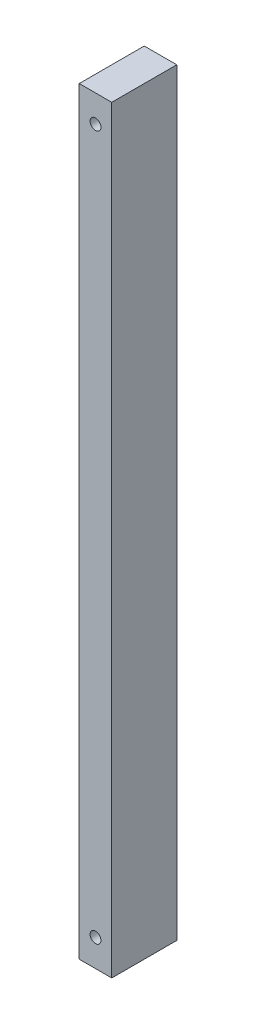
ISO-10303-21;
HEADER;
FILE_DESCRIPTION(('STEP AP214'),'2;1');
FILE_NAME('part.step','',(''),(''),'','','');
FILE_SCHEMA(('AUTOMOTIVE_DESIGN { 1 0 10303 214 1 1 1 1 }'));
ENDSEC;
DATA;
#1=APPLICATION_CONTEXT('core data for automotive mechanical design processes');
#2=APPLICATION_PROTOCOL_DEFINITION('international standard','automotive_design',2000,#1);
#3=PRODUCT_CONTEXT('',#1,'mechanical');
#4=PRODUCT('Part','Part','',(#3));
#5=PRODUCT_RELATED_PRODUCT_CATEGORY('part','',(#4));
#6=PRODUCT_DEFINITION_FORMATION('','',#4);
#7=PRODUCT_DEFINITION_CONTEXT('part definition',#1,'design');
#8=PRODUCT_DEFINITION('design','',#6,#7);
#9=PRODUCT_DEFINITION_SHAPE('','',#8);
#10=(LENGTH_UNIT() NAMED_UNIT(*) SI_UNIT(.MILLI.,.METRE.));
#11=(NAMED_UNIT(*) PLANE_ANGLE_UNIT() SI_UNIT($,.RADIAN.));
#12=(NAMED_UNIT(*) SI_UNIT($,.STERADIAN.) SOLID_ANGLE_UNIT());
#13=UNCERTAINTY_MEASURE_WITH_UNIT(LENGTH_MEASURE(1.E-05),#10,'distance_accuracy_value','');
#14=(GEOMETRIC_REPRESENTATION_CONTEXT(3) GLOBAL_UNCERTAINTY_ASSIGNED_CONTEXT((#13)) GLOBAL_UNIT_ASSIGNED_CONTEXT((#10,
#11,#12)) REPRESENTATION_CONTEXT('',''));
#15=CARTESIAN_POINT('',(0.,0.,0.));
#16=DIRECTION('',(0.,0.,1.));
#17=DIRECTION('',(1.,0.,0.));
#18=AXIS2_PLACEMENT_3D('',#15,#16,#17);
#19=CARTESIAN_POINT('',(19.05,0.,0.));
#20=DIRECTION('',(0.,0.,-1.));
#21=DIRECTION('',(-1.,0.,0.));
#22=AXIS2_PLACEMENT_3D('',#19,#20,#21);
#23=PLANE('',#22);
#24=CARTESIAN_POINT('',(9.525,428.625,0.));
#25=DIRECTION('',(0.,0.,1.));
#26=DIRECTION('',(1.,0.,0.));
#27=AXIS2_PLACEMENT_3D('',#24,#25,#26);
#28=CIRCLE('',#27,3.175);
#29=CARTESIAN_POINT('',(12.7,428.625,0.));
#30=VERTEX_POINT('',#29);
#31=EDGE_CURVE('E117',#30,#30,#28,.T.);
#32=ORIENTED_EDGE('',*,*,#31,.F.);
#33=EDGE_LOOP('',(#32));
#34=FACE_BOUND('',#33,.T.);
#35=CARTESIAN_POINT('',(9.52500000000005,15.875,0.));
#36=DIRECTION('',(0.,0.,1.));
#37=DIRECTION('',(1.,0.,0.));
#38=AXIS2_PLACEMENT_3D('',#35,#36,#37);
#39=CIRCLE('',#38,3.175);
#40=CARTESIAN_POINT('',(12.7000000000001,15.875,0.));
#41=VERTEX_POINT('',#40);
#42=EDGE_CURVE('E111',#41,#41,#39,.T.);
#43=ORIENTED_EDGE('',*,*,#42,.F.);
#44=EDGE_LOOP('',(#43));
#45=FACE_BOUND('',#44,.T.);
#46=DIRECTION('',(0.,-1.,0.));
#47=VECTOR('',#46,1.);
#48=CARTESIAN_POINT('',(0.,0.,0.));
#49=LINE('',#48,#47);
#50=CARTESIAN_POINT('',(0.,444.5,0.));
#51=VERTEX_POINT('',#50);
#52=CARTESIAN_POINT('',(0.,0.,0.));
#53=VERTEX_POINT('',#52);
#54=EDGE_CURVE('E97',#51,#53,#49,.T.);
#55=ORIENTED_EDGE('',*,*,#54,.T.);
#56=DIRECTION('',(-1.,0.,0.));
#57=VECTOR('',#56,1.);
#58=CARTESIAN_POINT('',(19.05,0.,0.));
#59=LINE('',#58,#57);
#60=CARTESIAN_POINT('',(19.05,0.,0.));
#61=VERTEX_POINT('',#60);
#62=EDGE_CURVE('E11',#61,#53,#59,.T.);
#63=ORIENTED_EDGE('',*,*,#62,.F.);
#64=DIRECTION('',(0.,-1.,0.));
#65=VECTOR('',#64,1.);
#66=CARTESIAN_POINT('',(19.05,0.,0.));
#67=LINE('',#66,#65);
#68=CARTESIAN_POINT('',(19.05,444.5,0.));
#69=VERTEX_POINT('',#68);
#70=EDGE_CURVE('E85',#69,#61,#67,.T.);
#71=ORIENTED_EDGE('',*,*,#70,.F.);
#72=DIRECTION('',(-1.,0.,0.));
#73=VECTOR('',#72,1.);
#74=CARTESIAN_POINT('',(19.05,444.5,0.));
#75=LINE('',#74,#73);
#76=EDGE_CURVE('E93',#69,#51,#75,.T.);
#77=ORIENTED_EDGE('',*,*,#76,.T.);
#78=EDGE_LOOP('',(#55,#63,#71,#77));
#79=FACE_BOUND('',#78,.T.);
#80=ADVANCED_FACE('F34',(#34,#45,#79),#23,.F.);
#81=CARTESIAN_POINT('',(19.05,0.,0.));
#82=DIRECTION('',(0.,1.,0.));
#83=DIRECTION('',(0.,0.,1.));
#84=AXIS2_PLACEMENT_3D('',#81,#82,#83);
#85=PLANE('',#84);
#86=DIRECTION('',(0.,0.,-1.));
#87=VECTOR('',#86,1.);
#88=CARTESIAN_POINT('',(0.,0.,0.));
#89=LINE('',#88,#87);
#90=CARTESIAN_POINT('',(0.,0.,-38.1));
#91=VERTEX_POINT('',#90);
#92=EDGE_CURVE('E89',#53,#91,#89,.T.);
#93=ORIENTED_EDGE('',*,*,#92,.T.);
#94=DIRECTION('',(-1.,0.,0.));
#95=VECTOR('',#94,1.);
#96=CARTESIAN_POINT('',(19.05,0.,-38.1));
#97=LINE('',#96,#95);
#98=CARTESIAN_POINT('',(19.05,0.,-38.1));
#99=VERTEX_POINT('',#98);
#100=EDGE_CURVE('E42',#99,#91,#97,.T.);
#101=ORIENTED_EDGE('',*,*,#100,.F.);
#102=DIRECTION('',(0.,0.,-1.));
#103=VECTOR('',#102,1.);
#104=CARTESIAN_POINT('',(19.05,0.,0.));
#105=LINE('',#104,#103);
#106=EDGE_CURVE('E80',#61,#99,#105,.T.);
#107=ORIENTED_EDGE('',*,*,#106,.F.);
#108=ORIENTED_EDGE('',*,*,#62,.T.);
#109=EDGE_LOOP('',(#93,#101,#107,#108));
#110=FACE_BOUND('',#109,.T.);
#111=ADVANCED_FACE('F88',(#110),#85,.F.);
#112=CARTESIAN_POINT('',(19.05,0.,-38.1));
#113=DIRECTION('',(0.,0.,1.));
#114=DIRECTION('',(1.,0.,0.));
#115=AXIS2_PLACEMENT_3D('',#112,#113,#114);
#116=PLANE('',#115);
#117=CARTESIAN_POINT('',(9.525,428.625,-38.1));
#118=DIRECTION('',(0.,0.,1.));
#119=DIRECTION('',(1.,0.,0.));
#120=AXIS2_PLACEMENT_3D('',#117,#118,#119);
#121=CIRCLE('',#120,3.175);
#122=CARTESIAN_POINT('',(12.7,428.625,-38.1));
#123=VERTEX_POINT('',#122);
#124=EDGE_CURVE('E114',#123,#123,#121,.T.);
#125=ORIENTED_EDGE('',*,*,#124,.T.);
#126=EDGE_LOOP('',(#125));
#127=FACE_BOUND('',#126,.T.);
#128=CARTESIAN_POINT('',(9.52500000000005,15.875,-38.1));
#129=DIRECTION('',(0.,0.,1.));
#130=DIRECTION('',(1.,0.,0.));
#131=AXIS2_PLACEMENT_3D('',#128,#129,#130);
#132=CIRCLE('',#131,3.175);
#133=CARTESIAN_POINT('',(12.7000000000001,15.875,-38.1));
#134=VERTEX_POINT('',#133);
#135=EDGE_CURVE('E100',#134,#134,#132,.T.);
#136=ORIENTED_EDGE('',*,*,#135,.T.);
#137=EDGE_LOOP('',(#136));
#138=FACE_BOUND('',#137,.T.);
#139=DIRECTION('',(0.,1.,0.));
#140=VECTOR('',#139,1.);
#141=CARTESIAN_POINT('',(0.,0.,-38.1));
#142=LINE('',#141,#140);
#143=CARTESIAN_POINT('',(0.,444.5,-38.1));
#144=VERTEX_POINT('',#143);
#145=EDGE_CURVE('E67',#91,#144,#142,.T.);
#146=ORIENTED_EDGE('',*,*,#145,.T.);
#147=DIRECTION('',(-1.,0.,0.));
#148=VECTOR('',#147,1.);
#149=CARTESIAN_POINT('',(19.05,444.5,-38.1));
#150=LINE('',#149,#148);
#151=CARTESIAN_POINT('',(19.05,444.5,-38.1));
#152=VERTEX_POINT('',#151);
#153=EDGE_CURVE('E90',#152,#144,#150,.T.);
#154=ORIENTED_EDGE('',*,*,#153,.F.);
#155=DIRECTION('',(0.,1.,0.));
#156=VECTOR('',#155,1.);
#157=CARTESIAN_POINT('',(19.05,0.,-38.1));
#158=LINE('',#157,#156);
#159=EDGE_CURVE('E83',#99,#152,#158,.T.);
#160=ORIENTED_EDGE('',*,*,#159,.F.);
#161=ORIENTED_EDGE('',*,*,#100,.T.);
#162=EDGE_LOOP('',(#146,#154,#160,#161));
#163=FACE_BOUND('',#162,.T.);
#164=ADVANCED_FACE('F91',(#127,#138,#163),#116,.F.);
#165=CARTESIAN_POINT('',(19.05,444.5,0.));
#166=DIRECTION('',(0.,-1.,0.));
#167=DIRECTION('',(0.,0.,-1.));
#168=AXIS2_PLACEMENT_3D('',#165,#166,#167);
#169=PLANE('',#168);
#170=DIRECTION('',(0.,0.,1.));
#171=VECTOR('',#170,1.);
#172=CARTESIAN_POINT('',(0.,444.5,0.));
#173=LINE('',#172,#171);
#174=EDGE_CURVE('E73',#144,#51,#173,.T.);
#175=ORIENTED_EDGE('',*,*,#174,.T.);
#176=ORIENTED_EDGE('',*,*,#76,.F.);
#177=DIRECTION('',(0.,0.,1.));
#178=VECTOR('',#177,1.);
#179=CARTESIAN_POINT('',(19.05,444.5,0.));
#180=LINE('',#179,#178);
#181=EDGE_CURVE('E50',#152,#69,#180,.T.);
#182=ORIENTED_EDGE('',*,*,#181,.F.);
#183=ORIENTED_EDGE('',*,*,#153,.T.);
#184=EDGE_LOOP('',(#175,#176,#182,#183));
#185=FACE_BOUND('',#184,.T.);
#186=ADVANCED_FACE('F105',(#185),#169,.F.);
#187=CARTESIAN_POINT('',(19.05,0.,0.));
#188=DIRECTION('',(-1.,0.,0.));
#189=DIRECTION('',(0.,0.,1.));
#190=AXIS2_PLACEMENT_3D('',#187,#188,#189);
#191=PLANE('',#190);
#192=ORIENTED_EDGE('',*,*,#70,.T.);
#193=ORIENTED_EDGE('',*,*,#106,.T.);
#194=ORIENTED_EDGE('',*,*,#159,.T.);
#195=ORIENTED_EDGE('',*,*,#181,.T.);
#196=EDGE_LOOP('',(#192,#193,#194,#195));
#197=FACE_BOUND('',#196,.T.);
#198=ADVANCED_FACE('F81',(#197),#191,.F.);
#199=CARTESIAN_POINT('',(0.,0.,0.));
#200=DIRECTION('',(-1.,0.,0.));
#201=DIRECTION('',(0.,0.,1.));
#202=AXIS2_PLACEMENT_3D('',#199,#200,#201);
#203=PLANE('',#202);
#204=ORIENTED_EDGE('',*,*,#54,.F.);
#205=ORIENTED_EDGE('',*,*,#174,.F.);
#206=ORIENTED_EDGE('',*,*,#145,.F.);
#207=ORIENTED_EDGE('',*,*,#92,.F.);
#208=EDGE_LOOP('',(#204,#205,#206,#207));
#209=FACE_BOUND('',#208,.T.);
#210=ADVANCED_FACE('F108',(#209),#203,.T.);
#211=CARTESIAN_POINT('',(9.52500000000005,15.875,-38.1));
#212=DIRECTION('',(0.,0.,1.));
#213=DIRECTION('',(1.,0.,0.));
#214=AXIS2_PLACEMENT_3D('',#211,#212,#213);
#215=CYLINDRICAL_SURFACE('',#214,3.175);
#216=ORIENTED_EDGE('',*,*,#135,.F.);
#217=EDGE_LOOP('',(#216));
#218=FACE_BOUND('',#217,.T.);
#219=ORIENTED_EDGE('',*,*,#42,.T.);
#220=EDGE_LOOP('',(#219));
#221=FACE_BOUND('',#220,.T.);
#222=ADVANCED_FACE('F128',(#218,#221),#215,.F.);
#223=CARTESIAN_POINT('',(9.525,428.625,-38.1));
#224=DIRECTION('',(0.,0.,1.));
#225=DIRECTION('',(1.,0.,0.));
#226=AXIS2_PLACEMENT_3D('',#223,#224,#225);
#227=CYLINDRICAL_SURFACE('',#226,3.175);
#228=ORIENTED_EDGE('',*,*,#124,.F.);
#229=EDGE_LOOP('',(#228));
#230=FACE_BOUND('',#229,.T.);
#231=ORIENTED_EDGE('',*,*,#31,.T.);
#232=EDGE_LOOP('',(#231));
#233=FACE_BOUND('',#232,.T.);
#234=ADVANCED_FACE('F125',(#230,#233),#227,.F.);
#235=CLOSED_SHELL('',(#80,#111,#164,#186,#198,#210,#222,#234));
#236=MANIFOLD_SOLID_BREP('B2',#235);
#237=ADVANCED_BREP_SHAPE_REPRESENTATION('',(#18,#236),#14);
#238=SHAPE_DEFINITION_REPRESENTATION(#9,#237);
ENDSEC;
END-ISO-10303-21;
